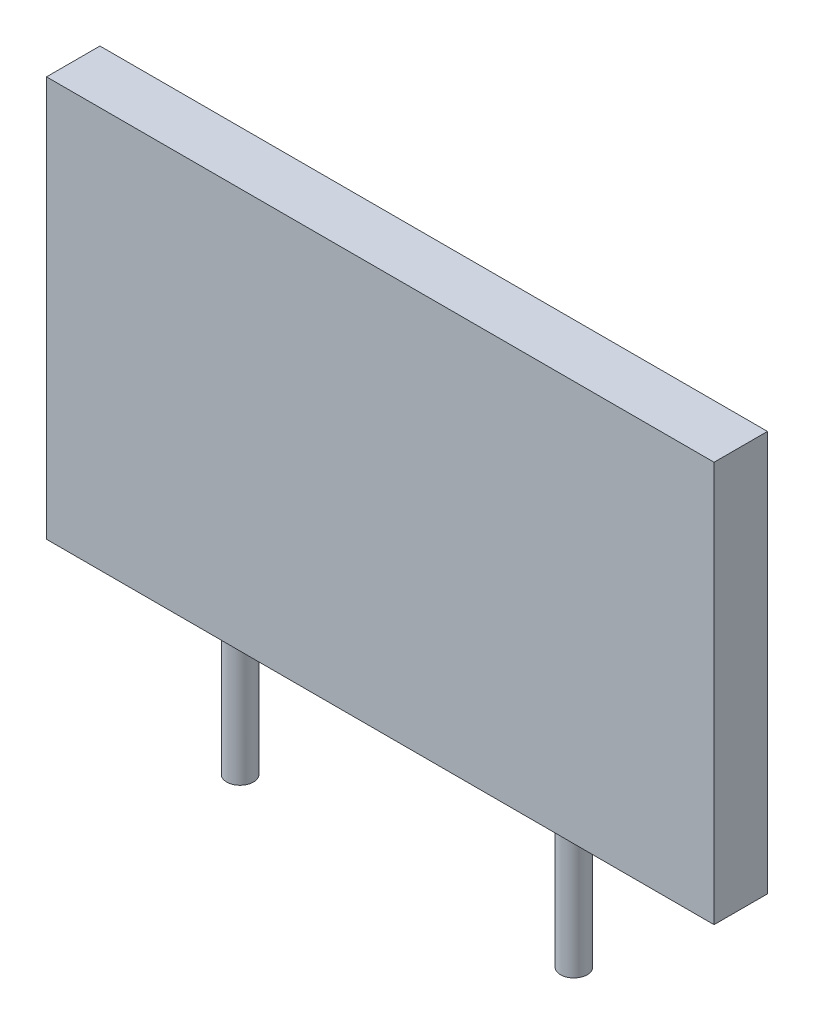
ISO-10303-21;
HEADER;
FILE_DESCRIPTION(('STEP AP214'),'2;1');
FILE_NAME('part.step','',(''),(''),'','','');
FILE_SCHEMA(('AUTOMOTIVE_DESIGN { 1 0 10303 214 1 1 1 1 }'));
ENDSEC;
DATA;
#1=APPLICATION_CONTEXT('core data for automotive mechanical design processes');
#2=APPLICATION_PROTOCOL_DEFINITION('international standard','automotive_design',2000,#1);
#3=PRODUCT_CONTEXT('',#1,'mechanical');
#4=PRODUCT('Part','Part','',(#3));
#5=PRODUCT_RELATED_PRODUCT_CATEGORY('part','',(#4));
#6=PRODUCT_DEFINITION_FORMATION('','',#4);
#7=PRODUCT_DEFINITION_CONTEXT('part definition',#1,'design');
#8=PRODUCT_DEFINITION('design','',#6,#7);
#9=PRODUCT_DEFINITION_SHAPE('','',#8);
#10=(LENGTH_UNIT() NAMED_UNIT(*) SI_UNIT(.MILLI.,.METRE.));
#11=(NAMED_UNIT(*) PLANE_ANGLE_UNIT() SI_UNIT($,.RADIAN.));
#12=(NAMED_UNIT(*) SI_UNIT($,.STERADIAN.) SOLID_ANGLE_UNIT());
#13=UNCERTAINTY_MEASURE_WITH_UNIT(LENGTH_MEASURE(1.E-05),#10,'distance_accuracy_value','');
#14=(GEOMETRIC_REPRESENTATION_CONTEXT(3) GLOBAL_UNCERTAINTY_ASSIGNED_CONTEXT((#13)) GLOBAL_UNIT_ASSIGNED_CONTEXT((#10,
#11,#12)) REPRESENTATION_CONTEXT('',''));
#15=CARTESIAN_POINT('',(0.,0.,0.));
#16=DIRECTION('',(0.,0.,1.));
#17=DIRECTION('',(1.,0.,0.));
#18=AXIS2_PLACEMENT_3D('',#15,#16,#17);
#19=CARTESIAN_POINT('',(125.,0.,-10.));
#20=DIRECTION('',(0.,0.,1.));
#21=DIRECTION('',(0.,-1.,0.));
#22=AXIS2_PLACEMENT_3D('',#19,#20,#21);
#23=PLANE('',#22);
#24=DIRECTION('',(0.,1.,0.));
#25=VECTOR('',#24,1.);
#26=CARTESIAN_POINT('',(-125.,0.,-9.99999999999998));
#27=LINE('',#26,#25);
#28=CARTESIAN_POINT('',(-125.,0.,-9.99999999999998));
#29=VERTEX_POINT('',#28);
#30=CARTESIAN_POINT('',(-125.,150.,-10.0000000000001));
#31=VERTEX_POINT('',#30);
#32=EDGE_CURVE('E100',#29,#31,#27,.T.);
#33=ORIENTED_EDGE('',*,*,#32,.T.);
#34=DIRECTION('',(-1.,0.,0.));
#35=VECTOR('',#34,1.);
#36=CARTESIAN_POINT('',(125.,150.,-9.9999999999999));
#37=LINE('',#36,#35);
#38=CARTESIAN_POINT('',(125.,150.,-9.9999999999999));
#39=VERTEX_POINT('',#38);
#40=EDGE_CURVE('E42',#39,#31,#37,.T.);
#41=ORIENTED_EDGE('',*,*,#40,.F.);
#42=DIRECTION('',(0.,1.,0.));
#43=VECTOR('',#42,1.);
#44=CARTESIAN_POINT('',(125.,0.,-10.));
#45=LINE('',#44,#43);
#46=CARTESIAN_POINT('',(125.,0.,-10.));
#47=VERTEX_POINT('',#46);
#48=EDGE_CURVE('E86',#47,#39,#45,.T.);
#49=ORIENTED_EDGE('',*,*,#48,.F.);
#50=DIRECTION('',(-1.,0.,0.));
#51=VECTOR('',#50,1.);
#52=CARTESIAN_POINT('',(125.,0.,-10.));
#53=LINE('',#52,#51);
#54=EDGE_CURVE('E96',#47,#29,#53,.T.);
#55=ORIENTED_EDGE('',*,*,#54,.T.);
#56=EDGE_LOOP('',(#33,#41,#49,#55));
#57=FACE_BOUND('',#56,.T.);
#58=ADVANCED_FACE('F34',(#57),#23,.F.);
#59=CARTESIAN_POINT('',(125.,150.,-9.9999999999999));
#60=DIRECTION('',(0.,-1.,0.));
#61=DIRECTION('',(0.,0.,-1.));
#62=AXIS2_PLACEMENT_3D('',#59,#60,#61);
#63=PLANE('',#62);
#64=DIRECTION('',(0.,0.,1.));
#65=VECTOR('',#64,1.);
#66=CARTESIAN_POINT('',(-125.,150.,-10.0000000000001));
#67=LINE('',#66,#65);
#68=CARTESIAN_POINT('',(-125.,150.,9.9999999999997));
#69=VERTEX_POINT('',#68);
#70=EDGE_CURVE('E91',#31,#69,#67,.T.);
#71=ORIENTED_EDGE('',*,*,#70,.T.);
#72=DIRECTION('',(-1.,0.,0.));
#73=VECTOR('',#72,1.);
#74=CARTESIAN_POINT('',(125.,150.,10.));
#75=LINE('',#74,#73);
#76=CARTESIAN_POINT('',(125.,150.,10.));
#77=VERTEX_POINT('',#76);
#78=EDGE_CURVE('E89',#77,#69,#75,.T.);
#79=ORIENTED_EDGE('',*,*,#78,.F.);
#80=DIRECTION('',(0.,0.,1.));
#81=VECTOR('',#80,1.);
#82=CARTESIAN_POINT('',(125.,150.,-9.9999999999999));
#83=LINE('',#82,#81);
#84=EDGE_CURVE('E81',#39,#77,#83,.T.);
#85=ORIENTED_EDGE('',*,*,#84,.F.);
#86=ORIENTED_EDGE('',*,*,#40,.T.);
#87=EDGE_LOOP('',(#71,#79,#85,#86));
#88=FACE_BOUND('',#87,.T.);
#89=ADVANCED_FACE('F90',(#88),#63,.F.);
#90=CARTESIAN_POINT('',(125.,2.22044604925031E-13,9.99999999999998));
#91=DIRECTION('',(0.,0.,-1.));
#92=DIRECTION('',(-1.,0.,0.));
#93=AXIS2_PLACEMENT_3D('',#90,#91,#92);
#94=PLANE('',#93);
#95=DIRECTION('',(0.,-1.,0.));
#96=VECTOR('',#95,1.);
#97=CARTESIAN_POINT('',(-125.,-1.11022302462516E-13,10.0000000000002));
#98=LINE('',#97,#96);
#99=CARTESIAN_POINT('',(-125.,-1.11022302462516E-13,10.0000000000002));
#100=VERTEX_POINT('',#99);
#101=EDGE_CURVE('E67',#69,#100,#98,.T.);
#102=ORIENTED_EDGE('',*,*,#101,.T.);
#103=DIRECTION('',(-1.,0.,0.));
#104=VECTOR('',#103,1.);
#105=CARTESIAN_POINT('',(125.,2.22044604925031E-13,9.99999999999998));
#106=LINE('',#105,#104);
#107=CARTESIAN_POINT('',(125.,2.22044604925031E-13,9.99999999999998));
#108=VERTEX_POINT('',#107);
#109=EDGE_CURVE('E92',#108,#100,#106,.T.);
#110=ORIENTED_EDGE('',*,*,#109,.F.);
#111=DIRECTION('',(0.,-1.,0.));
#112=VECTOR('',#111,1.);
#113=CARTESIAN_POINT('',(125.,2.22044604925031E-13,9.99999999999998));
#114=LINE('',#113,#112);
#115=EDGE_CURVE('E84',#77,#108,#114,.T.);
#116=ORIENTED_EDGE('',*,*,#115,.F.);
#117=ORIENTED_EDGE('',*,*,#78,.T.);
#118=EDGE_LOOP('',(#102,#110,#116,#117));
#119=FACE_BOUND('',#118,.T.);
#120=ADVANCED_FACE('F94',(#119),#94,.F.);
#121=CARTESIAN_POINT('',(125.,0.,-10.));
#122=DIRECTION('',(0.,1.,0.));
#123=DIRECTION('',(0.,0.,1.));
#124=AXIS2_PLACEMENT_3D('',#121,#122,#123);
#125=PLANE('',#124);
#126=CARTESIAN_POINT('',(62.5,0.,0.));
#127=DIRECTION('',(0.,1.,0.));
#128=DIRECTION('',(0.,0.,-1.));
#129=AXIS2_PLACEMENT_3D('',#126,#127,#128);
#130=CIRCLE('',#129,5.);
#131=CARTESIAN_POINT('',(62.5,0.,-5.00000000000001));
#132=VERTEX_POINT('',#131);
#133=EDGE_CURVE('E140',#132,#132,#130,.T.);
#134=ORIENTED_EDGE('',*,*,#133,.T.);
#135=EDGE_LOOP('',(#134));
#136=FACE_BOUND('',#135,.T.);
#137=CARTESIAN_POINT('',(-62.5,0.,0.));
#138=DIRECTION('',(0.,1.,0.));
#139=DIRECTION('',(0.,0.,1.));
#140=AXIS2_PLACEMENT_3D('',#137,#138,#139);
#141=CIRCLE('',#140,5.);
#142=CARTESIAN_POINT('',(-62.5,0.,4.99999999999998));
#143=VERTEX_POINT('',#142);
#144=EDGE_CURVE('E11',#143,#143,#141,.F.);
#145=ORIENTED_EDGE('',*,*,#144,.F.);
#146=EDGE_LOOP('',(#145));
#147=FACE_BOUND('',#146,.T.);
#148=DIRECTION('',(0.,0.,-1.));
#149=VECTOR('',#148,1.);
#150=CARTESIAN_POINT('',(-125.,0.,-9.99999999999998));
#151=LINE('',#150,#149);
#152=EDGE_CURVE('E73',#100,#29,#151,.T.);
#153=ORIENTED_EDGE('',*,*,#152,.T.);
#154=ORIENTED_EDGE('',*,*,#54,.F.);
#155=DIRECTION('',(0.,0.,-1.));
#156=VECTOR('',#155,1.);
#157=CARTESIAN_POINT('',(125.,0.,-10.));
#158=LINE('',#157,#156);
#159=EDGE_CURVE('E50',#108,#47,#158,.T.);
#160=ORIENTED_EDGE('',*,*,#159,.F.);
#161=ORIENTED_EDGE('',*,*,#109,.T.);
#162=EDGE_LOOP('',(#153,#154,#160,#161));
#163=FACE_BOUND('',#162,.T.);
#164=ADVANCED_FACE('F122',(#136,#147,#163),#125,.F.);
#165=CARTESIAN_POINT('',(125.,2.22044604925031E-13,0.));
#166=DIRECTION('',(1.,0.,0.));
#167=DIRECTION('',(0.,0.,-1.));
#168=AXIS2_PLACEMENT_3D('',#165,#166,#167);
#169=PLANE('',#168);
#170=ORIENTED_EDGE('',*,*,#48,.T.);
#171=ORIENTED_EDGE('',*,*,#84,.T.);
#172=ORIENTED_EDGE('',*,*,#115,.T.);
#173=ORIENTED_EDGE('',*,*,#159,.T.);
#174=EDGE_LOOP('',(#170,#171,#172,#173));
#175=FACE_BOUND('',#174,.T.);
#176=ADVANCED_FACE('F82',(#175),#169,.T.);
#177=CARTESIAN_POINT('',(-125.,0.,-1.11022302462516E-13));
#178=DIRECTION('',(1.,0.,0.));
#179=DIRECTION('',(0.,0.,-1.));
#180=AXIS2_PLACEMENT_3D('',#177,#178,#179);
#181=PLANE('',#180);
#182=ORIENTED_EDGE('',*,*,#32,.F.);
#183=ORIENTED_EDGE('',*,*,#152,.F.);
#184=ORIENTED_EDGE('',*,*,#101,.F.);
#185=ORIENTED_EDGE('',*,*,#70,.F.);
#186=EDGE_LOOP('',(#182,#183,#184,#185));
#187=FACE_BOUND('',#186,.T.);
#188=ADVANCED_FACE('F111',(#187),#181,.F.);
#189=CARTESIAN_POINT('',(-62.5000000000001,-50.0000000000003,0.));
#190=DIRECTION('',(0.,1.,0.));
#191=DIRECTION('',(0.,0.,1.));
#192=AXIS2_PLACEMENT_3D('',#189,#190,#191);
#193=CYLINDRICAL_SURFACE('',#192,5.);
#194=CARTESIAN_POINT('',(-62.5000000000001,-50.0000000000003,0.));
#195=DIRECTION('',(0.,-1.,0.));
#196=DIRECTION('',(0.,0.,-1.));
#197=AXIS2_PLACEMENT_3D('',#194,#195,#196);
#198=CIRCLE('',#197,5.);
#199=CARTESIAN_POINT('',(-62.5000000000001,-50.0000000000003,-5.00000000000001));
#200=VERTEX_POINT('',#199);
#201=EDGE_CURVE('E103',#200,#200,#198,.T.);
#202=ORIENTED_EDGE('',*,*,#201,.F.);
#203=EDGE_LOOP('',(#202));
#204=FACE_BOUND('',#203,.T.);
#205=ORIENTED_EDGE('',*,*,#144,.T.);
#206=EDGE_LOOP('',(#205));
#207=FACE_BOUND('',#206,.T.);
#208=ADVANCED_FACE('F113',(#204,#207),#193,.T.);
#209=CARTESIAN_POINT('',(-62.5000000000001,-50.0000000000003,0.));
#210=DIRECTION('',(0.,-1.,0.));
#211=DIRECTION('',(0.,0.,-1.));
#212=AXIS2_PLACEMENT_3D('',#209,#210,#211);
#213=PLANE('',#212);
#214=ORIENTED_EDGE('',*,*,#201,.T.);
#215=EDGE_LOOP('',(#214));
#216=FACE_BOUND('',#215,.T.);
#217=ADVANCED_FACE('F119',(#216),#213,.T.);
#218=CARTESIAN_POINT('',(62.4999999999999,-50.0000000000003,1.11022302462516E-13));
#219=DIRECTION('',(0.,1.,0.));
#220=DIRECTION('',(0.,0.,1.));
#221=AXIS2_PLACEMENT_3D('',#218,#219,#220);
#222=CYLINDRICAL_SURFACE('',#221,5.);
#223=CARTESIAN_POINT('',(62.4999999999999,-50.0000000000003,1.11022302462516E-13));
#224=DIRECTION('',(0.,1.,0.));
#225=DIRECTION('',(0.,0.,-1.));
#226=AXIS2_PLACEMENT_3D('',#223,#224,#225);
#227=CIRCLE('',#226,5.);
#228=CARTESIAN_POINT('',(62.4999999999999,-50.0000000000003,-4.9999999999999));
#229=VERTEX_POINT('',#228);
#230=EDGE_CURVE('E144',#229,#229,#227,.T.);
#231=ORIENTED_EDGE('',*,*,#230,.T.);
#232=EDGE_LOOP('',(#231));
#233=FACE_BOUND('',#232,.T.);
#234=ORIENTED_EDGE('',*,*,#133,.F.);
#235=EDGE_LOOP('',(#234));
#236=FACE_BOUND('',#235,.T.);
#237=ADVANCED_FACE('F153',(#233,#236),#222,.T.);
#238=CARTESIAN_POINT('',(62.4999999999999,-50.0000000000003,1.11022302462516E-13));
#239=DIRECTION('',(0.,-1.,0.));
#240=DIRECTION('',(0.,0.,-1.));
#241=AXIS2_PLACEMENT_3D('',#238,#239,#240);
#242=PLANE('',#241);
#243=ORIENTED_EDGE('',*,*,#230,.F.);
#244=EDGE_LOOP('',(#243));
#245=FACE_BOUND('',#244,.T.);
#246=ADVANCED_FACE('F158',(#245),#242,.T.);
#247=CLOSED_SHELL('',(#58,#89,#120,#164,#176,#188,#208,#217,#237,#246));
#248=MANIFOLD_SOLID_BREP('B2',#247);
#249=ADVANCED_BREP_SHAPE_REPRESENTATION('',(#18,#248),#14);
#250=SHAPE_DEFINITION_REPRESENTATION(#9,#249);
ENDSEC;
END-ISO-10303-21;
